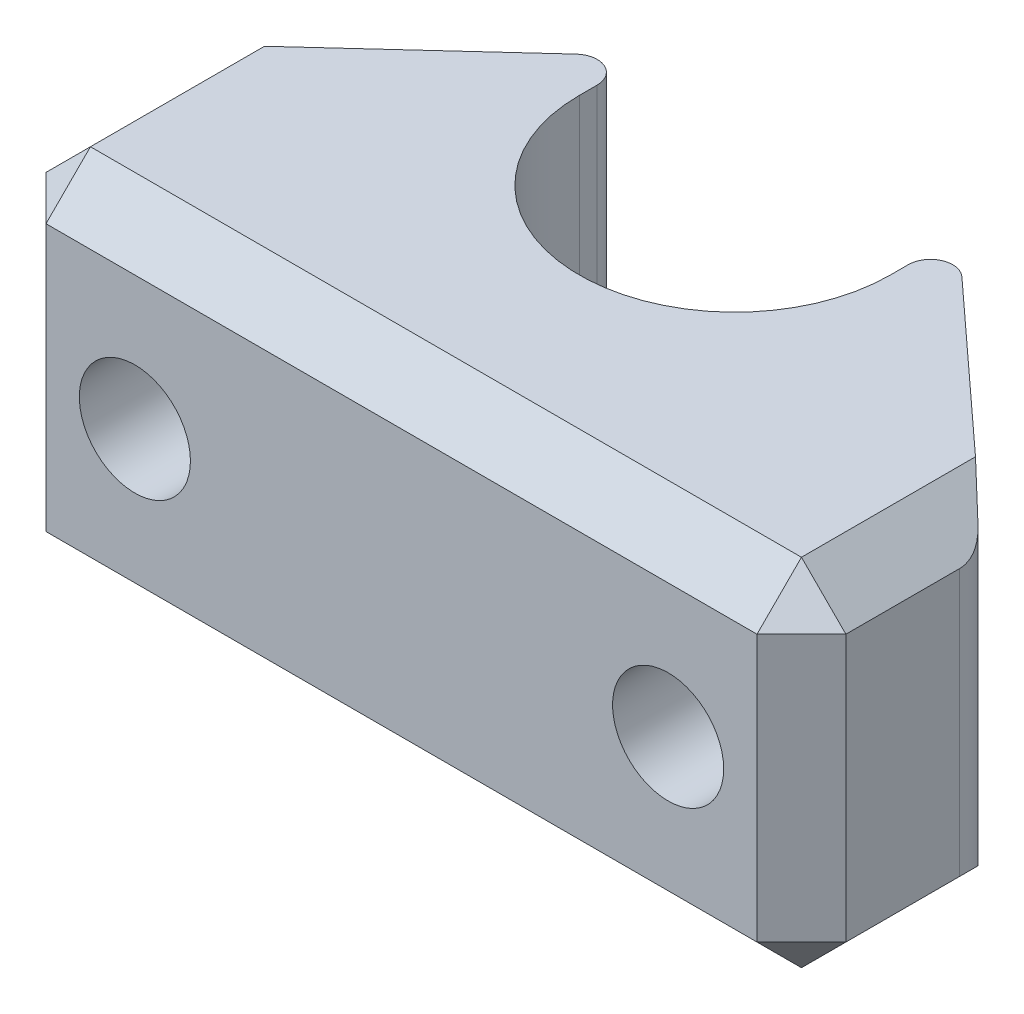
ISO-10303-21;
HEADER;
FILE_DESCRIPTION(('STEP AP214'),'2;1');
FILE_NAME('part.step','',(''),(''),'','','');
FILE_SCHEMA(('AUTOMOTIVE_DESIGN { 1 0 10303 214 1 1 1 1 }'));
ENDSEC;
DATA;
#1=APPLICATION_CONTEXT('core data for automotive mechanical design processes');
#2=APPLICATION_PROTOCOL_DEFINITION('international standard','automotive_design',2000,#1);
#3=PRODUCT_CONTEXT('',#1,'mechanical');
#4=PRODUCT('Part','Part','',(#3));
#5=PRODUCT_RELATED_PRODUCT_CATEGORY('part','',(#4));
#6=PRODUCT_DEFINITION_FORMATION('','',#4);
#7=PRODUCT_DEFINITION_CONTEXT('part definition',#1,'design');
#8=PRODUCT_DEFINITION('design','',#6,#7);
#9=PRODUCT_DEFINITION_SHAPE('','',#8);
#10=(LENGTH_UNIT() NAMED_UNIT(*) SI_UNIT(.MILLI.,.METRE.));
#11=(NAMED_UNIT(*) PLANE_ANGLE_UNIT() SI_UNIT($,.RADIAN.));
#12=(NAMED_UNIT(*) SI_UNIT($,.STERADIAN.) SOLID_ANGLE_UNIT());
#13=UNCERTAINTY_MEASURE_WITH_UNIT(LENGTH_MEASURE(1.E-05),#10,'distance_accuracy_value','');
#14=(GEOMETRIC_REPRESENTATION_CONTEXT(3) GLOBAL_UNCERTAINTY_ASSIGNED_CONTEXT((#13)) GLOBAL_UNIT_ASSIGNED_CONTEXT((#10,
#11,#12)) REPRESENTATION_CONTEXT('',''));
#15=CARTESIAN_POINT('',(0.,0.,0.));
#16=DIRECTION('',(0.,0.,1.));
#17=DIRECTION('',(1.,0.,0.));
#18=AXIS2_PLACEMENT_3D('',#15,#16,#17);
#19=CARTESIAN_POINT('',(0.,4.,0.));
#20=DIRECTION('',(0.,-1.,0.));
#21=DIRECTION('',(0.,0.,-1.));
#22=AXIS2_PLACEMENT_3D('',#19,#20,#21);
#23=CYLINDRICAL_SURFACE('',#22,3.5);
#24=CARTESIAN_POINT('',(0.,-1.,0.));
#25=DIRECTION('',(0.,1.,0.));
#26=DIRECTION('',(0.,0.,1.));
#27=AXIS2_PLACEMENT_3D('',#24,#25,#26);
#28=CIRCLE('',#27,3.5);
#29=CARTESIAN_POINT('',(2.36461126005362,-1.,-2.58042895442359));
#30=VERTEX_POINT('',#29);
#31=CARTESIAN_POINT('',(-2.36461126005362,-1.,-2.58042895442359));
#32=VERTEX_POINT('',#31);
#33=EDGE_CURVE('E207',#30,#32,#28,.T.);
#34=ORIENTED_EDGE('',*,*,#33,.F.);
#35=DIRECTION('',(0.,-1.,0.));
#36=VECTOR('',#35,1.);
#37=CARTESIAN_POINT('',(2.36461126005362,4.,-2.58042895442359));
#38=LINE('',#37,#36);
#39=CARTESIAN_POINT('',(2.36461126005362,-4.,-2.58042895442359));
#40=VERTEX_POINT('',#39);
#41=EDGE_CURVE('E246',#30,#40,#38,.T.);
#42=ORIENTED_EDGE('',*,*,#41,.T.);
#43=CARTESIAN_POINT('',(0.,-4.,0.));
#44=DIRECTION('',(0.,1.,0.));
#45=DIRECTION('',(0.,0.,-1.));
#46=AXIS2_PLACEMENT_3D('',#43,#44,#45);
#47=CIRCLE('',#46,3.5);
#48=CARTESIAN_POINT('',(-2.36461126005362,-4.,-2.58042895442359));
#49=VERTEX_POINT('',#48);
#50=EDGE_CURVE('E240',#40,#49,#47,.T.);
#51=ORIENTED_EDGE('',*,*,#50,.T.);
#52=DIRECTION('',(0.,-1.,0.));
#53=VECTOR('',#52,1.);
#54=CARTESIAN_POINT('',(-2.36461126005362,4.,-2.58042895442359));
#55=LINE('',#54,#53);
#56=EDGE_CURVE('E238',#32,#49,#55,.T.);
#57=ORIENTED_EDGE('',*,*,#56,.F.);
#58=EDGE_LOOP('',(#34,#42,#51,#57));
#59=FACE_BOUND('',#58,.T.);
#60=ADVANCED_FACE('F42',(#59),#23,.T.);
#61=CARTESIAN_POINT('',(0.,4.,0.));
#62=DIRECTION('',(0.,-1.,0.));
#63=DIRECTION('',(0.,0.,-1.));
#64=AXIS2_PLACEMENT_3D('',#61,#62,#63);
#65=CYLINDRICAL_SURFACE('',#64,2.);
#66=CARTESIAN_POINT('',(0.,-4.,0.));
#67=DIRECTION('',(0.,1.,0.));
#68=DIRECTION('',(0.,0.,1.));
#69=AXIS2_PLACEMENT_3D('',#66,#67,#68);
#70=CIRCLE('',#69,2.);
#71=CARTESIAN_POINT('',(0.,-4.,2.));
#72=VERTEX_POINT('',#71);
#73=EDGE_CURVE('E228',#72,#72,#70,.T.);
#74=ORIENTED_EDGE('',*,*,#73,.F.);
#75=EDGE_LOOP('',(#74));
#76=FACE_BOUND('',#75,.T.);
#77=CARTESIAN_POINT('',(0.,-1.,0.));
#78=DIRECTION('',(0.,1.,0.));
#79=DIRECTION('',(0.,0.,1.));
#80=AXIS2_PLACEMENT_3D('',#77,#78,#79);
#81=CIRCLE('',#80,2.);
#82=CARTESIAN_POINT('',(0.,-1.,2.));
#83=VERTEX_POINT('',#82);
#84=EDGE_CURVE('E214',#83,#83,#81,.T.);
#85=ORIENTED_EDGE('',*,*,#84,.T.);
#86=EDGE_LOOP('',(#85));
#87=FACE_BOUND('',#86,.T.);
#88=ADVANCED_FACE('F461',(#76,#87),#65,.F.);
#89=CARTESIAN_POINT('',(0.,4.,0.));
#90=DIRECTION('',(0.,-1.,0.));
#91=DIRECTION('',(0.,0.,-1.));
#92=AXIS2_PLACEMENT_3D('',#89,#90,#91);
#93=PLANE('',#92);
#94=DIRECTION('',(-0.737265415549598,0.,-0.675603217158177));
#95=VECTOR('',#94,1.);
#96=CARTESIAN_POINT('',(9.,4.,3.5));
#97=LINE('',#96,#95);
#98=CARTESIAN_POINT('',(8.,4.,2.58363636363637));
#99=VERTEX_POINT('',#98);
#100=CARTESIAN_POINT('',(4.33780160857909,4.,-0.772269071411163));
#101=VERTEX_POINT('',#100);
#102=EDGE_CURVE('E232',#99,#101,#97,.T.);
#103=ORIENTED_EDGE('',*,*,#102,.T.);
#104=CARTESIAN_POINT('',(4.,4.,-0.403636363636364));
#105=DIRECTION('',(0.,-1.,0.));
#106=DIRECTION('',(0.,0.,-1.));
#107=AXIS2_PLACEMENT_3D('',#104,#105,#106);
#108=CIRCLE('',#107,0.5);
#109=CARTESIAN_POINT('',(3.5,4.,-0.403636363636364));
#110=VERTEX_POINT('',#109);
#111=EDGE_CURVE('E355',#101,#110,#108,.F.);
#112=ORIENTED_EDGE('',*,*,#111,.T.);
#113=DIRECTION('',(0.,0.,-1.));
#114=VECTOR('',#113,1.);
#115=CARTESIAN_POINT('',(3.5,4.,0.));
#116=LINE('',#115,#114);
#117=CARTESIAN_POINT('',(3.5,4.,0.));
#118=VERTEX_POINT('',#117);
#119=EDGE_CURVE('E203',#118,#110,#116,.T.);
#120=ORIENTED_EDGE('',*,*,#119,.F.);
#121=CARTESIAN_POINT('',(0.,4.,0.));
#122=DIRECTION('',(0.,1.,0.));
#123=DIRECTION('',(0.,0.,1.));
#124=AXIS2_PLACEMENT_3D('',#121,#122,#123);
#125=CIRCLE('',#124,3.5);
#126=CARTESIAN_POINT('',(-3.5,4.,0.));
#127=VERTEX_POINT('',#126);
#128=EDGE_CURVE('E183',#127,#118,#125,.T.);
#129=ORIENTED_EDGE('',*,*,#128,.F.);
#130=DIRECTION('',(0.,0.,1.));
#131=VECTOR('',#130,1.);
#132=CARTESIAN_POINT('',(-3.5,4.,0.));
#133=LINE('',#132,#131);
#134=CARTESIAN_POINT('',(-3.5,4.,-0.403636363636363));
#135=VERTEX_POINT('',#134);
#136=EDGE_CURVE('E201',#135,#127,#133,.T.);
#137=ORIENTED_EDGE('',*,*,#136,.F.);
#138=CARTESIAN_POINT('',(-4.,4.,-0.403636363636363));
#139=DIRECTION('',(0.,-1.,0.));
#140=DIRECTION('',(0.,0.,-1.));
#141=AXIS2_PLACEMENT_3D('',#138,#139,#140);
#142=CIRCLE('',#141,0.5);
#143=CARTESIAN_POINT('',(-4.33780160857909,4.,-0.772269071411162));
#144=VERTEX_POINT('',#143);
#145=EDGE_CURVE('E353',#135,#144,#142,.F.);
#146=ORIENTED_EDGE('',*,*,#145,.T.);
#147=DIRECTION('',(-0.737265415549598,0.,0.675603217158177));
#148=VECTOR('',#147,1.);
#149=CARTESIAN_POINT('',(-9.,4.,3.5));
#150=LINE('',#149,#148);
#151=CARTESIAN_POINT('',(-8.00000000000001,4.,2.58363636363637));
#152=VERTEX_POINT('',#151);
#153=EDGE_CURVE('E235',#144,#152,#150,.T.);
#154=ORIENTED_EDGE('',*,*,#153,.T.);
#155=DIRECTION('',(0.,0.,1.));
#156=VECTOR('',#155,1.);
#157=CARTESIAN_POINT('',(-8.00000000000001,4.,0.));
#158=LINE('',#157,#156);
#159=CARTESIAN_POINT('',(-8.00000000000001,4.,6.50000000000001));
#160=VERTEX_POINT('',#159);
#161=EDGE_CURVE('E255',#152,#160,#158,.T.);
#162=ORIENTED_EDGE('',*,*,#161,.T.);
#163=DIRECTION('',(1.,0.,0.));
#164=VECTOR('',#163,1.);
#165=CARTESIAN_POINT('',(0.,4.,6.50000000000001));
#166=LINE('',#165,#164);
#167=CARTESIAN_POINT('',(8.,4.,6.50000000000001));
#168=VERTEX_POINT('',#167);
#169=EDGE_CURVE('E249',#160,#168,#166,.T.);
#170=ORIENTED_EDGE('',*,*,#169,.T.);
#171=DIRECTION('',(0.,0.,-1.));
#172=VECTOR('',#171,1.);
#173=CARTESIAN_POINT('',(8.,4.,0.));
#174=LINE('',#173,#172);
#175=EDGE_CURVE('E253',#168,#99,#174,.T.);
#176=ORIENTED_EDGE('',*,*,#175,.T.);
#177=EDGE_LOOP('',(#103,#112,#120,#129,#137,#146,#154,#162,#170,#176));
#178=FACE_BOUND('',#177,.T.);
#179=ADVANCED_FACE('F372',(#178),#93,.F.);
#180=CARTESIAN_POINT('',(0.,-4.,0.));
#181=DIRECTION('',(0.,-1.,0.));
#182=DIRECTION('',(0.,0.,-1.));
#183=AXIS2_PLACEMENT_3D('',#180,#181,#182);
#184=PLANE('',#183);
#185=DIRECTION('',(-1.,0.,0.));
#186=VECTOR('',#185,1.);
#187=CARTESIAN_POINT('',(-9.,-4.,6.50000000000001));
#188=LINE('',#187,#186);
#189=CARTESIAN_POINT('',(8.,-4.,6.50000000000001));
#190=VERTEX_POINT('',#189);
#191=CARTESIAN_POINT('',(-8.,-4.,6.50000000000001));
#192=VERTEX_POINT('',#191);
#193=EDGE_CURVE('E271',#190,#192,#188,.T.);
#194=ORIENTED_EDGE('',*,*,#193,.T.);
#195=DIRECTION('',(0.,0.,-1.));
#196=VECTOR('',#195,1.);
#197=CARTESIAN_POINT('',(-8.,-4.,3.5));
#198=LINE('',#197,#196);
#199=CARTESIAN_POINT('',(-8.,-4.,2.58363636363637));
#200=VERTEX_POINT('',#199);
#201=EDGE_CURVE('E275',#192,#200,#198,.T.);
#202=ORIENTED_EDGE('',*,*,#201,.T.);
#203=DIRECTION('',(-0.737265415549598,0.,0.675603217158177));
#204=VECTOR('',#203,1.);
#205=CARTESIAN_POINT('',(-9.,-4.,3.5));
#206=LINE('',#205,#204);
#207=EDGE_CURVE('E236',#49,#200,#206,.T.);
#208=ORIENTED_EDGE('',*,*,#207,.F.);
#209=ORIENTED_EDGE('',*,*,#50,.F.);
#210=DIRECTION('',(-0.737265415549598,0.,-0.675603217158177));
#211=VECTOR('',#210,1.);
#212=CARTESIAN_POINT('',(9.,-4.,3.5));
#213=LINE('',#212,#211);
#214=CARTESIAN_POINT('',(8.,-4.,2.58363636363637));
#215=VERTEX_POINT('',#214);
#216=EDGE_CURVE('E231',#215,#40,#213,.T.);
#217=ORIENTED_EDGE('',*,*,#216,.F.);
#218=DIRECTION('',(0.,0.,1.));
#219=VECTOR('',#218,1.);
#220=CARTESIAN_POINT('',(8.,-4.,7.5));
#221=LINE('',#220,#219);
#222=EDGE_CURVE('E273',#215,#190,#221,.T.);
#223=ORIENTED_EDGE('',*,*,#222,.T.);
#224=EDGE_LOOP('',(#194,#202,#208,#209,#217,#223));
#225=FACE_BOUND('',#224,.T.);
#226=ORIENTED_EDGE('',*,*,#73,.T.);
#227=EDGE_LOOP('',(#226));
#228=FACE_BOUND('',#227,.T.);
#229=ADVANCED_FACE('F428',(#225,#228),#184,.T.);
#230=CARTESIAN_POINT('',(9.,4.,7.5));
#231=DIRECTION('',(-1.,0.,0.));
#232=DIRECTION('',(0.,0.,1.));
#233=AXIS2_PLACEMENT_3D('',#230,#231,#232);
#234=PLANE('',#233);
#235=DIRECTION('',(0.,0.,-1.));
#236=VECTOR('',#235,1.);
#237=CARTESIAN_POINT('',(9.,-3.00000000000001,3.5));
#238=LINE('',#237,#236);
#239=CARTESIAN_POINT('',(9.,-3.00000000000001,6.50000000000001));
#240=VERTEX_POINT('',#239);
#241=CARTESIAN_POINT('',(9.,-3.00000000000001,3.94));
#242=VERTEX_POINT('',#241);
#243=EDGE_CURVE('E281',#240,#242,#238,.T.);
#244=ORIENTED_EDGE('',*,*,#243,.T.);
#245=DIRECTION('',(0.,-1.,0.));
#246=VECTOR('',#245,1.);
#247=CARTESIAN_POINT('',(9.,4.,3.94));
#248=LINE('',#247,#246);
#249=CARTESIAN_POINT('',(9.,3.00000000000001,3.94));
#250=VERTEX_POINT('',#249);
#251=EDGE_CURVE('E337',#242,#250,#248,.F.);
#252=ORIENTED_EDGE('',*,*,#251,.T.);
#253=DIRECTION('',(0.,0.,1.));
#254=VECTOR('',#253,1.);
#255=CARTESIAN_POINT('',(9.,3.00000000000001,7.5));
#256=LINE('',#255,#254);
#257=CARTESIAN_POINT('',(9.,3.00000000000001,6.50000000000001));
#258=VERTEX_POINT('',#257);
#259=EDGE_CURVE('E279',#250,#258,#256,.T.);
#260=ORIENTED_EDGE('',*,*,#259,.T.);
#261=DIRECTION('',(0.,-1.,0.));
#262=VECTOR('',#261,1.);
#263=CARTESIAN_POINT('',(9.,4.,6.50000000000001));
#264=LINE('',#263,#262);
#265=EDGE_CURVE('E277',#258,#240,#264,.T.);
#266=ORIENTED_EDGE('',*,*,#265,.T.);
#267=EDGE_LOOP('',(#244,#252,#260,#266));
#268=FACE_BOUND('',#267,.T.);
#269=ADVANCED_FACE('F415',(#268),#234,.F.);
#270=CARTESIAN_POINT('',(9.,4.,3.5));
#271=DIRECTION('',(-0.675603217158177,0.,0.737265415549598));
#272=DIRECTION('',(0.737265415549598,0.,0.675603217158177));
#273=AXIS2_PLACEMENT_3D('',#270,#271,#272);
#274=PLANE('',#273);
#275=CARTESIAN_POINT('',(6.,0.,0.75090909090909));
#276=DIRECTION('',(-0.675603217158177,0.,0.737265415549598));
#277=DIRECTION('',(0.737265415549598,0.,0.675603217158177));
#278=AXIS2_PLACEMENT_3D('',#275,#276,#277);
#279=ELLIPSE('',#278,1.69545454545454,1.25);
#280=CARTESIAN_POINT('',(7.25,0.,1.89636363636363));
#281=VERTEX_POINT('',#280);
#282=EDGE_CURVE('E225',#281,#281,#279,.T.);
#283=ORIENTED_EDGE('',*,*,#282,.T.);
#284=EDGE_LOOP('',(#283));
#285=FACE_BOUND('',#284,.T.);
#286=DIRECTION('',(-0.737265415549598,0.,-0.675603217158177));
#287=VECTOR('',#286,1.);
#288=CARTESIAN_POINT('',(3.5,-1.,-1.54));
#289=LINE('',#288,#287);
#290=CARTESIAN_POINT('',(4.33780160857909,-1.,-0.772269071411163));
#291=VERTEX_POINT('',#290);
#292=EDGE_CURVE('E197',#291,#30,#289,.T.);
#293=ORIENTED_EDGE('',*,*,#292,.F.);
#294=DIRECTION('',(0.,1.,0.));
#295=VECTOR('',#294,1.);
#296=CARTESIAN_POINT('',(4.33780160857909,4.,-0.772269071411163));
#297=LINE('',#296,#295);
#298=EDGE_CURVE('E350',#291,#101,#297,.T.);
#299=ORIENTED_EDGE('',*,*,#298,.T.);
#300=ORIENTED_EDGE('',*,*,#102,.F.);
#301=DIRECTION('',(-0.5934198411358,0.593419841135798,-0.543788363513533));
#302=VECTOR('',#301,1.);
#303=CARTESIAN_POINT('',(7.16627396928579,4.83372603071421,1.81964014640007));
#304=LINE('',#303,#302);
#305=CARTESIAN_POINT('',(8.67560321715818,3.32439678284183,3.2027345844504));
#306=VERTEX_POINT('',#305);
#307=EDGE_CURVE('E284',#99,#306,#304,.F.);
#308=ORIENTED_EDGE('',*,*,#307,.T.);
#309=DIRECTION('',(0.,-1.,0.));
#310=VECTOR('',#309,1.);
#311=CARTESIAN_POINT('',(8.67560321715818,4.,3.2027345844504));
#312=LINE('',#311,#310);
#313=CARTESIAN_POINT('',(8.67560321715818,-3.32439678284183,3.2027345844504));
#314=VERTEX_POINT('',#313);
#315=EDGE_CURVE('E298',#306,#314,#312,.T.);
#316=ORIENTED_EDGE('',*,*,#315,.T.);
#317=DIRECTION('',(-0.5934198411358,-0.593419841135798,-0.543788363513533));
#318=VECTOR('',#317,1.);
#319=CARTESIAN_POINT('',(10.2907792171508,-1.70922078284922,4.68282313717091));
#320=LINE('',#319,#318);
#321=EDGE_CURVE('E287',#314,#215,#320,.T.);
#322=ORIENTED_EDGE('',*,*,#321,.T.);
#323=ORIENTED_EDGE('',*,*,#216,.T.);
#324=ORIENTED_EDGE('',*,*,#41,.F.);
#325=EDGE_LOOP('',(#293,#299,#300,#308,#316,#322,#323,#324));
#326=FACE_BOUND('',#325,.T.);
#327=ADVANCED_FACE('F368',(#285,#326),#274,.F.);
#328=CARTESIAN_POINT('',(-9.,4.,3.5));
#329=DIRECTION('',(0.675603217158177,0.,0.737265415549598));
#330=DIRECTION('',(0.737265415549598,0.,-0.675603217158177));
#331=AXIS2_PLACEMENT_3D('',#328,#329,#330);
#332=PLANE('',#331);
#333=CARTESIAN_POINT('',(-6.,0.,0.75090909090909));
#334=DIRECTION('',(0.675603217158177,0.,0.737265415549598));
#335=DIRECTION('',(-0.737265415549598,0.,0.675603217158177));
#336=AXIS2_PLACEMENT_3D('',#333,#334,#335);
#337=ELLIPSE('',#336,1.69545454545454,1.25);
#338=CARTESIAN_POINT('',(-7.25,0.,1.89636363636363));
#339=VERTEX_POINT('',#338);
#340=EDGE_CURVE('E219',#339,#339,#337,.T.);
#341=ORIENTED_EDGE('',*,*,#340,.T.);
#342=EDGE_LOOP('',(#341));
#343=FACE_BOUND('',#342,.T.);
#344=ORIENTED_EDGE('',*,*,#153,.F.);
#345=DIRECTION('',(0.,1.,0.));
#346=VECTOR('',#345,1.);
#347=CARTESIAN_POINT('',(-4.33780160857909,4.,-0.772269071411162));
#348=LINE('',#347,#346);
#349=CARTESIAN_POINT('',(-4.33780160857909,-1.,-0.772269071411163));
#350=VERTEX_POINT('',#349);
#351=EDGE_CURVE('E361',#144,#350,#348,.F.);
#352=ORIENTED_EDGE('',*,*,#351,.T.);
#353=DIRECTION('',(-0.737265415549598,0.,0.675603217158177));
#354=VECTOR('',#353,1.);
#355=CARTESIAN_POINT('',(-2.36461126005362,-1.,-2.58042895442359));
#356=LINE('',#355,#354);
#357=EDGE_CURVE('E56',#32,#350,#356,.T.);
#358=ORIENTED_EDGE('',*,*,#357,.F.);
#359=ORIENTED_EDGE('',*,*,#56,.T.);
#360=ORIENTED_EDGE('',*,*,#207,.T.);
#361=DIRECTION('',(-0.5934198411358,0.593419841135798,0.543788363513533));
#362=VECTOR('',#361,1.);
#363=CARTESIAN_POINT('',(-10.2907792171508,-1.70922078284922,4.68282313717091));
#364=LINE('',#363,#362);
#365=CARTESIAN_POINT('',(-8.67560321715818,-3.32439678284183,3.2027345844504));
#366=VERTEX_POINT('',#365);
#367=EDGE_CURVE('E265',#200,#366,#364,.T.);
#368=ORIENTED_EDGE('',*,*,#367,.T.);
#369=DIRECTION('',(0.,-1.,0.));
#370=VECTOR('',#369,1.);
#371=CARTESIAN_POINT('',(-8.67560321715818,4.,3.2027345844504));
#372=LINE('',#371,#370);
#373=CARTESIAN_POINT('',(-8.67560321715818,3.32439678284183,3.2027345844504));
#374=VERTEX_POINT('',#373);
#375=EDGE_CURVE('E346',#366,#374,#372,.F.);
#376=ORIENTED_EDGE('',*,*,#375,.T.);
#377=DIRECTION('',(-0.593419841135798,-0.5934198411358,0.543788363513532));
#378=VECTOR('',#377,1.);
#379=CARTESIAN_POINT('',(-7.1662739692858,4.83372603071422,1.81964014640007));
#380=LINE('',#379,#378);
#381=EDGE_CURVE('E268',#374,#152,#380,.F.);
#382=ORIENTED_EDGE('',*,*,#381,.T.);
#383=EDGE_LOOP('',(#344,#352,#358,#359,#360,#368,#376,#382));
#384=FACE_BOUND('',#383,.T.);
#385=ADVANCED_FACE('F435',(#343,#384),#332,.F.);
#386=CARTESIAN_POINT('',(-9.,4.,7.5));
#387=DIRECTION('',(1.,0.,0.));
#388=DIRECTION('',(0.,0.,-1.));
#389=AXIS2_PLACEMENT_3D('',#386,#387,#388);
#390=PLANE('',#389);
#391=DIRECTION('',(0.,0.,-1.));
#392=VECTOR('',#391,1.);
#393=CARTESIAN_POINT('',(-9.,3.,7.5));
#394=LINE('',#393,#392);
#395=CARTESIAN_POINT('',(-9.,3.,6.50000000000001));
#396=VERTEX_POINT('',#395);
#397=CARTESIAN_POINT('',(-9.,3.,3.94));
#398=VERTEX_POINT('',#397);
#399=EDGE_CURVE('E262',#396,#398,#394,.T.);
#400=ORIENTED_EDGE('',*,*,#399,.T.);
#401=DIRECTION('',(0.,-1.,0.));
#402=VECTOR('',#401,1.);
#403=CARTESIAN_POINT('',(-9.,4.,3.94));
#404=LINE('',#403,#402);
#405=CARTESIAN_POINT('',(-9.,-3.00000000000001,3.94));
#406=VERTEX_POINT('',#405);
#407=EDGE_CURVE('E341',#398,#406,#404,.T.);
#408=ORIENTED_EDGE('',*,*,#407,.T.);
#409=DIRECTION('',(0.,0.,1.));
#410=VECTOR('',#409,1.);
#411=CARTESIAN_POINT('',(-9.,-3.00000000000001,7.5));
#412=LINE('',#411,#410);
#413=CARTESIAN_POINT('',(-9.,-3.00000000000001,6.50000000000001));
#414=VERTEX_POINT('',#413);
#415=EDGE_CURVE('E260',#406,#414,#412,.T.);
#416=ORIENTED_EDGE('',*,*,#415,.T.);
#417=DIRECTION('',(0.,1.,0.));
#418=VECTOR('',#417,1.);
#419=CARTESIAN_POINT('',(-9.,4.,6.50000000000001));
#420=LINE('',#419,#418);
#421=EDGE_CURVE('E258',#414,#396,#420,.T.);
#422=ORIENTED_EDGE('',*,*,#421,.T.);
#423=EDGE_LOOP('',(#400,#408,#416,#422));
#424=FACE_BOUND('',#423,.T.);
#425=ADVANCED_FACE('F575',(#424),#390,.F.);
#426=CARTESIAN_POINT('',(9.,4.,7.5));
#427=DIRECTION('',(0.,0.,-1.));
#428=DIRECTION('',(-1.,0.,0.));
#429=AXIS2_PLACEMENT_3D('',#426,#427,#428);
#430=PLANE('',#429);
#431=DIRECTION('',(0.,-1.,0.));
#432=VECTOR('',#431,1.);
#433=CARTESIAN_POINT('',(-8.,4.,7.5));
#434=LINE('',#433,#432);
#435=CARTESIAN_POINT('',(-8.,3.,7.5));
#436=VERTEX_POINT('',#435);
#437=CARTESIAN_POINT('',(-8.,-3.,7.5));
#438=VERTEX_POINT('',#437);
#439=EDGE_CURVE('E293',#436,#438,#434,.T.);
#440=ORIENTED_EDGE('',*,*,#439,.T.);
#441=DIRECTION('',(1.,0.,0.));
#442=VECTOR('',#441,1.);
#443=CARTESIAN_POINT('',(9.,-3.,7.5));
#444=LINE('',#443,#442);
#445=CARTESIAN_POINT('',(8.,-3.,7.5));
#446=VERTEX_POINT('',#445);
#447=EDGE_CURVE('E295',#438,#446,#444,.T.);
#448=ORIENTED_EDGE('',*,*,#447,.T.);
#449=DIRECTION('',(0.,1.,0.));
#450=VECTOR('',#449,1.);
#451=CARTESIAN_POINT('',(8.,4.,7.5));
#452=LINE('',#451,#450);
#453=CARTESIAN_POINT('',(8.,3.,7.5));
#454=VERTEX_POINT('',#453);
#455=EDGE_CURVE('E289',#446,#454,#452,.T.);
#456=ORIENTED_EDGE('',*,*,#455,.T.);
#457=DIRECTION('',(-1.,0.,0.));
#458=VECTOR('',#457,1.);
#459=CARTESIAN_POINT('',(9.,3.,7.5));
#460=LINE('',#459,#458);
#461=EDGE_CURVE('E291',#454,#436,#460,.T.);
#462=ORIENTED_EDGE('',*,*,#461,.T.);
#463=EDGE_LOOP('',(#440,#448,#456,#462));
#464=FACE_BOUND('',#463,.T.);
#465=CARTESIAN_POINT('',(-6.,0.,7.5));
#466=DIRECTION('',(0.,0.,1.));
#467=DIRECTION('',(1.,0.,0.));
#468=AXIS2_PLACEMENT_3D('',#465,#466,#467);
#469=CIRCLE('',#468,1.25);
#470=CARTESIAN_POINT('',(-4.75,0.,7.5));
#471=VERTEX_POINT('',#470);
#472=EDGE_CURVE('E216',#471,#471,#469,.T.);
#473=ORIENTED_EDGE('',*,*,#472,.F.);
#474=EDGE_LOOP('',(#473));
#475=FACE_BOUND('',#474,.T.);
#476=CARTESIAN_POINT('',(6.,0.,7.5));
#477=DIRECTION('',(0.,0.,1.));
#478=DIRECTION('',(1.,0.,0.));
#479=AXIS2_PLACEMENT_3D('',#476,#477,#478);
#480=CIRCLE('',#479,1.25);
#481=CARTESIAN_POINT('',(7.25,0.,7.5));
#482=VERTEX_POINT('',#481);
#483=EDGE_CURVE('E222',#482,#482,#480,.T.);
#484=ORIENTED_EDGE('',*,*,#483,.F.);
#485=EDGE_LOOP('',(#484));
#486=FACE_BOUND('',#485,.T.);
#487=ADVANCED_FACE('F389',(#464,#475,#486),#430,.F.);
#488=CARTESIAN_POINT('',(6.,0.,7.5));
#489=DIRECTION('',(0.,0.,1.));
#490=DIRECTION('',(1.,0.,0.));
#491=AXIS2_PLACEMENT_3D('',#488,#489,#490);
#492=CYLINDRICAL_SURFACE('',#491,1.25);
#493=ORIENTED_EDGE('',*,*,#483,.T.);
#494=EDGE_LOOP('',(#493));
#495=FACE_BOUND('',#494,.T.);
#496=ORIENTED_EDGE('',*,*,#282,.F.);
#497=EDGE_LOOP('',(#496));
#498=FACE_BOUND('',#497,.T.);
#499=ADVANCED_FACE('F704',(#495,#498),#492,.F.);
#500=CARTESIAN_POINT('',(-6.,0.,7.5));
#501=DIRECTION('',(0.,0.,1.));
#502=DIRECTION('',(1.,0.,0.));
#503=AXIS2_PLACEMENT_3D('',#500,#501,#502);
#504=CYLINDRICAL_SURFACE('',#503,1.25);
#505=ORIENTED_EDGE('',*,*,#472,.T.);
#506=EDGE_LOOP('',(#505));
#507=FACE_BOUND('',#506,.T.);
#508=ORIENTED_EDGE('',*,*,#340,.F.);
#509=EDGE_LOOP('',(#508));
#510=FACE_BOUND('',#509,.T.);
#511=ADVANCED_FACE('F720',(#507,#510),#504,.F.);
#512=CARTESIAN_POINT('',(0.,-1.,0.));
#513=DIRECTION('',(0.,1.,0.));
#514=DIRECTION('',(0.,0.,1.));
#515=AXIS2_PLACEMENT_3D('',#512,#513,#514);
#516=CYLINDRICAL_SURFACE('',#515,3.5);
#517=ORIENTED_EDGE('',*,*,#128,.T.);
#518=DIRECTION('',(0.,1.,0.));
#519=VECTOR('',#518,1.);
#520=CARTESIAN_POINT('',(3.5,-1.,0.));
#521=LINE('',#520,#519);
#522=CARTESIAN_POINT('',(3.5,-1.,0.));
#523=VERTEX_POINT('',#522);
#524=EDGE_CURVE('E176',#523,#118,#521,.T.);
#525=ORIENTED_EDGE('',*,*,#524,.F.);
#526=CARTESIAN_POINT('',(0.,-1.,0.));
#527=DIRECTION('',(0.,1.,0.));
#528=DIRECTION('',(0.,0.,1.));
#529=AXIS2_PLACEMENT_3D('',#526,#527,#528);
#530=CIRCLE('',#529,3.5);
#531=CARTESIAN_POINT('',(-3.5,-1.,0.));
#532=VERTEX_POINT('',#531);
#533=EDGE_CURVE('E181',#532,#523,#530,.T.);
#534=ORIENTED_EDGE('',*,*,#533,.F.);
#535=DIRECTION('',(0.,1.,0.));
#536=VECTOR('',#535,1.);
#537=CARTESIAN_POINT('',(-3.5,-1.,0.));
#538=LINE('',#537,#536);
#539=EDGE_CURVE('E187',#532,#127,#538,.T.);
#540=ORIENTED_EDGE('',*,*,#539,.T.);
#541=EDGE_LOOP('',(#517,#525,#534,#540));
#542=FACE_BOUND('',#541,.T.);
#543=ADVANCED_FACE('F178',(#542),#516,.F.);
#544=CARTESIAN_POINT('',(-3.5,-1.,0.));
#545=DIRECTION('',(-1.,0.,0.));
#546=DIRECTION('',(0.,0.,1.));
#547=AXIS2_PLACEMENT_3D('',#544,#545,#546);
#548=PLANE('',#547);
#549=DIRECTION('',(0.,0.,1.));
#550=VECTOR('',#549,1.);
#551=CARTESIAN_POINT('',(-3.5,-1.,0.));
#552=LINE('',#551,#550);
#553=CARTESIAN_POINT('',(-3.5,-1.,-0.403636363636363));
#554=VERTEX_POINT('',#553);
#555=EDGE_CURVE('E188',#554,#532,#552,.T.);
#556=ORIENTED_EDGE('',*,*,#555,.F.);
#557=DIRECTION('',(0.,1.,0.));
#558=VECTOR('',#557,1.);
#559=CARTESIAN_POINT('',(-3.5,-1.,-0.403636363636363));
#560=LINE('',#559,#558);
#561=EDGE_CURVE('E358',#554,#135,#560,.T.);
#562=ORIENTED_EDGE('',*,*,#561,.T.);
#563=ORIENTED_EDGE('',*,*,#136,.T.);
#564=ORIENTED_EDGE('',*,*,#539,.F.);
#565=EDGE_LOOP('',(#556,#562,#563,#564));
#566=FACE_BOUND('',#565,.T.);
#567=ADVANCED_FACE('F441',(#566),#548,.F.);
#568=CARTESIAN_POINT('',(3.5,-1.,0.));
#569=DIRECTION('',(1.,0.,0.));
#570=DIRECTION('',(0.,0.,-1.));
#571=AXIS2_PLACEMENT_3D('',#568,#569,#570);
#572=PLANE('',#571);
#573=ORIENTED_EDGE('',*,*,#119,.T.);
#574=DIRECTION('',(0.,1.,0.));
#575=VECTOR('',#574,1.);
#576=CARTESIAN_POINT('',(3.5,-1.,-0.403636363636364));
#577=LINE('',#576,#575);
#578=CARTESIAN_POINT('',(3.5,-1.,-0.403636363636364));
#579=VERTEX_POINT('',#578);
#580=EDGE_CURVE('E194',#110,#579,#577,.F.);
#581=ORIENTED_EDGE('',*,*,#580,.T.);
#582=DIRECTION('',(0.,0.,-1.));
#583=VECTOR('',#582,1.);
#584=CARTESIAN_POINT('',(3.5,-1.,0.));
#585=LINE('',#584,#583);
#586=EDGE_CURVE('E191',#523,#579,#585,.T.);
#587=ORIENTED_EDGE('',*,*,#586,.F.);
#588=ORIENTED_EDGE('',*,*,#524,.T.);
#589=EDGE_LOOP('',(#573,#581,#587,#588));
#590=FACE_BOUND('',#589,.T.);
#591=ADVANCED_FACE('F192',(#590),#572,.F.);
#592=CARTESIAN_POINT('',(0.,-1.,0.));
#593=DIRECTION('',(0.,1.,0.));
#594=DIRECTION('',(0.,0.,1.));
#595=AXIS2_PLACEMENT_3D('',#592,#593,#594);
#596=PLANE('',#595);
#597=ORIENTED_EDGE('',*,*,#84,.F.);
#598=EDGE_LOOP('',(#597));
#599=FACE_BOUND('',#598,.T.);
#600=ORIENTED_EDGE('',*,*,#533,.T.);
#601=ORIENTED_EDGE('',*,*,#586,.T.);
#602=CARTESIAN_POINT('',(4.,-1.,-0.403636363636364));
#603=DIRECTION('',(0.,1.,0.));
#604=DIRECTION('',(0.,0.,1.));
#605=AXIS2_PLACEMENT_3D('',#602,#603,#604);
#606=CIRCLE('',#605,0.5);
#607=EDGE_CURVE('E50',#579,#291,#606,.F.);
#608=ORIENTED_EDGE('',*,*,#607,.T.);
#609=ORIENTED_EDGE('',*,*,#292,.T.);
#610=ORIENTED_EDGE('',*,*,#33,.T.);
#611=ORIENTED_EDGE('',*,*,#357,.T.);
#612=CARTESIAN_POINT('',(-4.,-1.,-0.403636363636363));
#613=DIRECTION('',(0.,1.,0.));
#614=DIRECTION('',(0.,0.,1.));
#615=AXIS2_PLACEMENT_3D('',#612,#613,#614);
#616=CIRCLE('',#615,0.5);
#617=EDGE_CURVE('E11',#350,#554,#616,.F.);
#618=ORIENTED_EDGE('',*,*,#617,.T.);
#619=ORIENTED_EDGE('',*,*,#555,.T.);
#620=EDGE_LOOP('',(#600,#601,#608,#609,#610,#611,#618,#619));
#621=FACE_BOUND('',#620,.T.);
#622=ADVANCED_FACE('F199',(#599,#621),#596,.T.);
#623=CARTESIAN_POINT('',(9.,-3.00000000000001,7.5));
#624=DIRECTION('',(0.707106781186546,-0.707106781186549,0.));
#625=DIRECTION('',(0.,0.,1.));
#626=AXIS2_PLACEMENT_3D('',#623,#624,#625);
#627=PLANE('',#626);
#628=ORIENTED_EDGE('',*,*,#321,.F.);
#629=CARTESIAN_POINT('',(8.,-4.,3.94));
#630=DIRECTION('',(0.707106781186546,-0.707106781186549,0.));
#631=DIRECTION('',(-0.707106781186549,-0.707106781186546,0.));
#632=AXIS2_PLACEMENT_3D('',#629,#630,#631);
#633=ELLIPSE('',#632,1.41421356237309,1.);
#634=EDGE_CURVE('E335',#314,#242,#633,.T.);
#635=ORIENTED_EDGE('',*,*,#634,.T.);
#636=ORIENTED_EDGE('',*,*,#243,.F.);
#637=DIRECTION('',(0.707106781186549,0.707106781186546,0.));
#638=VECTOR('',#637,1.);
#639=CARTESIAN_POINT('',(8.,-4.,6.50000000000001));
#640=LINE('',#639,#638);
#641=EDGE_CURVE('E212',#190,#240,#640,.T.);
#642=ORIENTED_EDGE('',*,*,#641,.F.);
#643=ORIENTED_EDGE('',*,*,#222,.F.);
#644=EDGE_LOOP('',(#628,#635,#636,#642,#643));
#645=FACE_BOUND('',#644,.T.);
#646=ADVANCED_FACE('F419',(#645),#627,.T.);
#647=CARTESIAN_POINT('',(8.,-4.,6.50000000000001));
#648=DIRECTION('',(0.577350269189624,-0.577350269189626,0.577350269189628));
#649=DIRECTION('',(0.,-0.707106781186549,-0.707106781186546));
#650=AXIS2_PLACEMENT_3D('',#647,#648,#649);
#651=PLANE('',#650);
#652=DIRECTION('',(0.,-0.707106781186549,-0.707106781186546));
#653=VECTOR('',#652,1.);
#654=CARTESIAN_POINT('',(8.,-4.,6.50000000000001));
#655=LINE('',#654,#653);
#656=EDGE_CURVE('E325',#190,#446,#655,.F.);
#657=ORIENTED_EDGE('',*,*,#656,.F.);
#658=ORIENTED_EDGE('',*,*,#641,.T.);
#659=DIRECTION('',(0.707106781186549,0.,-0.707106781186546));
#660=VECTOR('',#659,1.);
#661=CARTESIAN_POINT('',(8.5,-3.,7.));
#662=LINE('',#661,#660);
#663=EDGE_CURVE('E328',#446,#240,#662,.T.);
#664=ORIENTED_EDGE('',*,*,#663,.F.);
#665=EDGE_LOOP('',(#657,#658,#664));
#666=FACE_BOUND('',#665,.T.);
#667=ADVANCED_FACE('F408',(#666),#651,.T.);
#668=CARTESIAN_POINT('',(8.,4.,0.));
#669=DIRECTION('',(-0.707106781186546,-0.707106781186549,0.));
#670=DIRECTION('',(0.,0.,-1.));
#671=AXIS2_PLACEMENT_3D('',#668,#669,#670);
#672=PLANE('',#671);
#673=ORIENTED_EDGE('',*,*,#259,.F.);
#674=CARTESIAN_POINT('',(8.,4.,3.94));
#675=DIRECTION('',(-0.707106781186546,-0.707106781186549,0.));
#676=DIRECTION('',(0.707106781186549,-0.707106781186546,0.));
#677=AXIS2_PLACEMENT_3D('',#674,#675,#676);
#678=ELLIPSE('',#677,1.41421356237309,1.);
#679=EDGE_CURVE('E339',#250,#306,#678,.F.);
#680=ORIENTED_EDGE('',*,*,#679,.T.);
#681=ORIENTED_EDGE('',*,*,#307,.F.);
#682=ORIENTED_EDGE('',*,*,#175,.F.);
#683=DIRECTION('',(0.707106781186549,-0.707106781186546,0.));
#684=VECTOR('',#683,1.);
#685=CARTESIAN_POINT('',(9.,3.00000000000001,6.50000000000001));
#686=LINE('',#685,#684);
#687=EDGE_CURVE('E322',#258,#168,#686,.F.);
#688=ORIENTED_EDGE('',*,*,#687,.F.);
#689=EDGE_LOOP('',(#673,#680,#681,#682,#688));
#690=FACE_BOUND('',#689,.T.);
#691=ADVANCED_FACE('F378',(#690),#672,.F.);
#692=CARTESIAN_POINT('',(9.,4.,6.50000000000001));
#693=DIRECTION('',(-0.707106781186546,0.,-0.707106781186549));
#694=DIRECTION('',(0.,-1.,0.));
#695=AXIS2_PLACEMENT_3D('',#692,#693,#694);
#696=PLANE('',#695);
#697=ORIENTED_EDGE('',*,*,#663,.T.);
#698=ORIENTED_EDGE('',*,*,#265,.F.);
#699=DIRECTION('',(-0.707106781186549,0.,0.707106781186546));
#700=VECTOR('',#699,1.);
#701=CARTESIAN_POINT('',(9.,3.00000000000001,6.50000000000001));
#702=LINE('',#701,#700);
#703=EDGE_CURVE('E319',#454,#258,#702,.F.);
#704=ORIENTED_EDGE('',*,*,#703,.F.);
#705=ORIENTED_EDGE('',*,*,#455,.F.);
#706=EDGE_LOOP('',(#697,#698,#704,#705));
#707=FACE_BOUND('',#706,.T.);
#708=ADVANCED_FACE('F412',(#707),#696,.F.);
#709=CARTESIAN_POINT('',(9.,-3.,7.5));
#710=DIRECTION('',(0.,-0.707106781186546,0.707106781186549));
#711=DIRECTION('',(-1.,0.,0.));
#712=AXIS2_PLACEMENT_3D('',#709,#710,#711);
#713=PLANE('',#712);
#714=ORIENTED_EDGE('',*,*,#656,.T.);
#715=ORIENTED_EDGE('',*,*,#447,.F.);
#716=DIRECTION('',(0.,0.707106781186549,0.707106781186546));
#717=VECTOR('',#716,1.);
#718=CARTESIAN_POINT('',(-8.,-3.5,7.));
#719=LINE('',#718,#717);
#720=EDGE_CURVE('E316',#192,#438,#719,.T.);
#721=ORIENTED_EDGE('',*,*,#720,.F.);
#722=ORIENTED_EDGE('',*,*,#193,.F.);
#723=EDGE_LOOP('',(#714,#715,#721,#722));
#724=FACE_BOUND('',#723,.T.);
#725=ADVANCED_FACE('F404',(#724),#713,.T.);
#726=CARTESIAN_POINT('',(-9.,-3.00000000000001,7.5));
#727=DIRECTION('',(-0.707106781186546,-0.707106781186549,0.));
#728=DIRECTION('',(0.,0.,-1.));
#729=AXIS2_PLACEMENT_3D('',#726,#727,#728);
#730=PLANE('',#729);
#731=ORIENTED_EDGE('',*,*,#415,.F.);
#732=CARTESIAN_POINT('',(-8.,-4.,3.94));
#733=DIRECTION('',(-0.707106781186546,-0.707106781186549,0.));
#734=DIRECTION('',(0.707106781186549,-0.707106781186546,0.));
#735=AXIS2_PLACEMENT_3D('',#732,#733,#734);
#736=ELLIPSE('',#735,1.41421356237309,1.);
#737=EDGE_CURVE('E344',#406,#366,#736,.T.);
#738=ORIENTED_EDGE('',*,*,#737,.T.);
#739=ORIENTED_EDGE('',*,*,#367,.F.);
#740=ORIENTED_EDGE('',*,*,#201,.F.);
#741=DIRECTION('',(0.707106781186549,-0.707106781186546,0.));
#742=VECTOR('',#741,1.);
#743=CARTESIAN_POINT('',(-9.,-3.00000000000001,6.50000000000001));
#744=LINE('',#743,#742);
#745=EDGE_CURVE('E313',#414,#192,#744,.T.);
#746=ORIENTED_EDGE('',*,*,#745,.F.);
#747=EDGE_LOOP('',(#731,#738,#739,#740,#746));
#748=FACE_BOUND('',#747,.T.);
#749=ADVANCED_FACE('F500',(#748),#730,.T.);
#750=CARTESIAN_POINT('',(9.,3.00000000000001,6.50000000000001));
#751=DIRECTION('',(0.577350269189624,0.577350269189626,0.577350269189628));
#752=DIRECTION('',(0.,-0.707106781186549,0.707106781186546));
#753=AXIS2_PLACEMENT_3D('',#750,#751,#752);
#754=PLANE('',#753);
#755=ORIENTED_EDGE('',*,*,#703,.T.);
#756=ORIENTED_EDGE('',*,*,#687,.T.);
#757=DIRECTION('',(0.,0.707106781186549,-0.707106781186546));
#758=VECTOR('',#757,1.);
#759=CARTESIAN_POINT('',(8.,3.5,7.));
#760=LINE('',#759,#758);
#761=EDGE_CURVE('E310',#454,#168,#760,.T.);
#762=ORIENTED_EDGE('',*,*,#761,.F.);
#763=EDGE_LOOP('',(#755,#756,#762));
#764=FACE_BOUND('',#763,.T.);
#765=ADVANCED_FACE('F381',(#764),#754,.T.);
#766=CARTESIAN_POINT('',(-9.,-3.00000000000001,6.50000000000001));
#767=DIRECTION('',(-0.577350269189624,-0.577350269189626,0.577350269189628));
#768=DIRECTION('',(0.,-0.707106781186549,-0.707106781186546));
#769=AXIS2_PLACEMENT_3D('',#766,#767,#768);
#770=PLANE('',#769);
#771=ORIENTED_EDGE('',*,*,#745,.T.);
#772=ORIENTED_EDGE('',*,*,#720,.T.);
#773=DIRECTION('',(0.707106781186549,0.,0.707106781186546));
#774=VECTOR('',#773,1.);
#775=CARTESIAN_POINT('',(-9.,-3.00000000000001,6.50000000000001));
#776=LINE('',#775,#774);
#777=EDGE_CURVE('E307',#414,#438,#776,.T.);
#778=ORIENTED_EDGE('',*,*,#777,.F.);
#779=EDGE_LOOP('',(#771,#772,#778));
#780=FACE_BOUND('',#779,.T.);
#781=ADVANCED_FACE('F399',(#780),#770,.T.);
#782=CARTESIAN_POINT('',(0.,4.,6.50000000000001));
#783=DIRECTION('',(0.,-0.707106781186546,-0.707106781186549));
#784=DIRECTION('',(1.,0.,0.));
#785=AXIS2_PLACEMENT_3D('',#782,#783,#784);
#786=PLANE('',#785);
#787=ORIENTED_EDGE('',*,*,#761,.T.);
#788=ORIENTED_EDGE('',*,*,#169,.F.);
#789=DIRECTION('',(0.,-0.707106781186549,0.707106781186546));
#790=VECTOR('',#789,1.);
#791=CARTESIAN_POINT('',(-8.00000000000001,4.,6.50000000000001));
#792=LINE('',#791,#790);
#793=EDGE_CURVE('E304',#436,#160,#792,.F.);
#794=ORIENTED_EDGE('',*,*,#793,.F.);
#795=ORIENTED_EDGE('',*,*,#461,.F.);
#796=EDGE_LOOP('',(#787,#788,#794,#795));
#797=FACE_BOUND('',#796,.T.);
#798=ADVANCED_FACE('F385',(#797),#786,.F.);
#799=CARTESIAN_POINT('',(-8.,4.,7.5));
#800=DIRECTION('',(0.707106781186546,0.,-0.707106781186549));
#801=DIRECTION('',(0.,-1.,0.));
#802=AXIS2_PLACEMENT_3D('',#799,#800,#801);
#803=PLANE('',#802);
#804=ORIENTED_EDGE('',*,*,#777,.T.);
#805=ORIENTED_EDGE('',*,*,#439,.F.);
#806=DIRECTION('',(-0.707106781186549,0.,-0.707106781186546));
#807=VECTOR('',#806,1.);
#808=CARTESIAN_POINT('',(-8.5,3.,7.));
#809=LINE('',#808,#807);
#810=EDGE_CURVE('E301',#396,#436,#809,.F.);
#811=ORIENTED_EDGE('',*,*,#810,.F.);
#812=ORIENTED_EDGE('',*,*,#421,.F.);
#813=EDGE_LOOP('',(#804,#805,#811,#812));
#814=FACE_BOUND('',#813,.T.);
#815=ADVANCED_FACE('F394',(#814),#803,.F.);
#816=CARTESIAN_POINT('',(-8.00000000000001,4.,6.50000000000001));
#817=DIRECTION('',(-0.577350269189626,0.577350269189624,0.577350269189628));
#818=DIRECTION('',(0.707106781186549,0.,0.707106781186546));
#819=AXIS2_PLACEMENT_3D('',#816,#817,#818);
#820=PLANE('',#819);
#821=ORIENTED_EDGE('',*,*,#810,.T.);
#822=ORIENTED_EDGE('',*,*,#793,.T.);
#823=DIRECTION('',(0.707106781186546,0.707106781186549,0.));
#824=VECTOR('',#823,1.);
#825=CARTESIAN_POINT('',(-8.00000000000001,4.,6.50000000000001));
#826=LINE('',#825,#824);
#827=EDGE_CURVE('E299',#396,#160,#826,.T.);
#828=ORIENTED_EDGE('',*,*,#827,.F.);
#829=EDGE_LOOP('',(#821,#822,#828));
#830=FACE_BOUND('',#829,.T.);
#831=ADVANCED_FACE('F450',(#830),#820,.T.);
#832=CARTESIAN_POINT('',(-8.00000000000001,4.,0.));
#833=DIRECTION('',(0.707106781186549,-0.707106781186546,0.));
#834=DIRECTION('',(0.,0.,1.));
#835=AXIS2_PLACEMENT_3D('',#832,#833,#834);
#836=PLANE('',#835);
#837=ORIENTED_EDGE('',*,*,#381,.F.);
#838=CARTESIAN_POINT('',(-8.,4.00000000000001,3.94));
#839=DIRECTION('',(0.707106781186549,-0.707106781186546,0.));
#840=DIRECTION('',(-0.707106781186546,-0.707106781186549,0.));
#841=AXIS2_PLACEMENT_3D('',#838,#839,#840);
#842=ELLIPSE('',#841,1.4142135623731,1.);
#843=EDGE_CURVE('E348',#374,#398,#842,.F.);
#844=ORIENTED_EDGE('',*,*,#843,.T.);
#845=ORIENTED_EDGE('',*,*,#399,.F.);
#846=ORIENTED_EDGE('',*,*,#827,.T.);
#847=ORIENTED_EDGE('',*,*,#161,.F.);
#848=EDGE_LOOP('',(#837,#844,#845,#846,#847));
#849=FACE_BOUND('',#848,.T.);
#850=ADVANCED_FACE('F447',(#849),#836,.F.);
#851=CARTESIAN_POINT('',(8.,4.,3.94));
#852=DIRECTION('',(0.,-1.,0.));
#853=DIRECTION('',(0.,0.,-1.));
#854=AXIS2_PLACEMENT_3D('',#851,#852,#853);
#855=CYLINDRICAL_SURFACE('',#854,1.);
#856=ORIENTED_EDGE('',*,*,#679,.F.);
#857=ORIENTED_EDGE('',*,*,#251,.F.);
#858=ORIENTED_EDGE('',*,*,#634,.F.);
#859=ORIENTED_EDGE('',*,*,#315,.F.);
#860=EDGE_LOOP('',(#856,#857,#858,#859));
#861=FACE_BOUND('',#860,.T.);
#862=ADVANCED_FACE('F424',(#861),#855,.T.);
#863=CARTESIAN_POINT('',(-8.,4.,3.94));
#864=DIRECTION('',(0.,-1.,0.));
#865=DIRECTION('',(0.,0.,-1.));
#866=AXIS2_PLACEMENT_3D('',#863,#864,#865);
#867=CYLINDRICAL_SURFACE('',#866,1.);
#868=ORIENTED_EDGE('',*,*,#843,.F.);
#869=ORIENTED_EDGE('',*,*,#375,.F.);
#870=ORIENTED_EDGE('',*,*,#737,.F.);
#871=ORIENTED_EDGE('',*,*,#407,.F.);
#872=EDGE_LOOP('',(#868,#869,#870,#871));
#873=FACE_BOUND('',#872,.T.);
#874=ADVANCED_FACE('F524',(#873),#867,.T.);
#875=CARTESIAN_POINT('',(4.,4.,-0.403636363636364));
#876=DIRECTION('',(0.,1.,0.));
#877=DIRECTION('',(0.,0.,1.));
#878=AXIS2_PLACEMENT_3D('',#875,#876,#877);
#879=CYLINDRICAL_SURFACE('',#878,0.5);
#880=ORIENTED_EDGE('',*,*,#607,.F.);
#881=ORIENTED_EDGE('',*,*,#580,.F.);
#882=ORIENTED_EDGE('',*,*,#111,.F.);
#883=ORIENTED_EDGE('',*,*,#298,.F.);
#884=EDGE_LOOP('',(#880,#881,#882,#883));
#885=FACE_BOUND('',#884,.T.);
#886=ADVANCED_FACE('F365',(#885),#879,.T.);
#887=CARTESIAN_POINT('',(-4.,-1.,-0.403636363636363));
#888=DIRECTION('',(0.,1.,0.));
#889=DIRECTION('',(0.,0.,1.));
#890=AXIS2_PLACEMENT_3D('',#887,#888,#889);
#891=CYLINDRICAL_SURFACE('',#890,0.5);
#892=ORIENTED_EDGE('',*,*,#617,.F.);
#893=ORIENTED_EDGE('',*,*,#351,.F.);
#894=ORIENTED_EDGE('',*,*,#145,.F.);
#895=ORIENTED_EDGE('',*,*,#561,.F.);
#896=EDGE_LOOP('',(#892,#893,#894,#895));
#897=FACE_BOUND('',#896,.T.);
#898=ADVANCED_FACE('F44',(#897),#891,.T.);
#899=CLOSED_SHELL('',(#60,#88,#179,#229,#269,#327,#385,#425,#487,#499,#511,#543,#567,#591,#622,
#646,#667,#691,#708,#725,#749,#765,#781,#798,#815,#831,#850,#862,#874,#886,#898));
#900=MANIFOLD_SOLID_BREP('B2',#899);
#901=ADVANCED_BREP_SHAPE_REPRESENTATION('',(#18,#900),#14);
#902=SHAPE_DEFINITION_REPRESENTATION(#9,#901);
ENDSEC;
END-ISO-10303-21;
